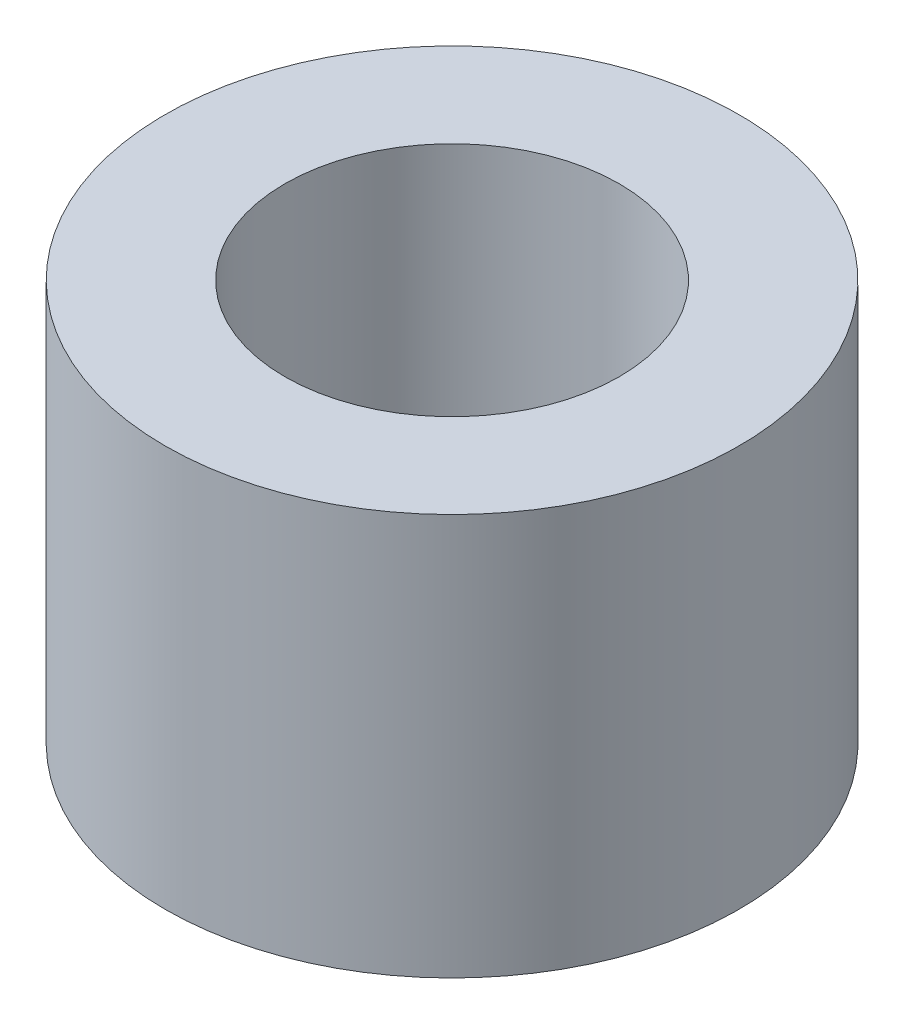
ISO-10303-21;
HEADER;
FILE_DESCRIPTION(('STEP AP214'),'2;1');
FILE_NAME('part.step','',(''),(''),'','','');
FILE_SCHEMA(('AUTOMOTIVE_DESIGN { 1 0 10303 214 1 1 1 1 }'));
ENDSEC;
DATA;
#1=APPLICATION_CONTEXT('core data for automotive mechanical design processes');
#2=APPLICATION_PROTOCOL_DEFINITION('international standard','automotive_design',2000,#1);
#3=PRODUCT_CONTEXT('',#1,'mechanical');
#4=PRODUCT('Part','Part','',(#3));
#5=PRODUCT_RELATED_PRODUCT_CATEGORY('part','',(#4));
#6=PRODUCT_DEFINITION_FORMATION('','',#4);
#7=PRODUCT_DEFINITION_CONTEXT('part definition',#1,'design');
#8=PRODUCT_DEFINITION('design','',#6,#7);
#9=PRODUCT_DEFINITION_SHAPE('','',#8);
#10=(LENGTH_UNIT() NAMED_UNIT(*) SI_UNIT(.MILLI.,.METRE.));
#11=(NAMED_UNIT(*) PLANE_ANGLE_UNIT() SI_UNIT($,.RADIAN.));
#12=(NAMED_UNIT(*) SI_UNIT($,.STERADIAN.) SOLID_ANGLE_UNIT());
#13=UNCERTAINTY_MEASURE_WITH_UNIT(LENGTH_MEASURE(1.E-05),#10,'distance_accuracy_value','');
#14=(GEOMETRIC_REPRESENTATION_CONTEXT(3) GLOBAL_UNCERTAINTY_ASSIGNED_CONTEXT((#13)) GLOBAL_UNIT_ASSIGNED_CONTEXT((#10,
#11,#12)) REPRESENTATION_CONTEXT('',''));
#15=CARTESIAN_POINT('',(0.,0.,0.));
#16=DIRECTION('',(0.,0.,1.));
#17=DIRECTION('',(1.,0.,0.));
#18=AXIS2_PLACEMENT_3D('',#15,#16,#17);
#19=CARTESIAN_POINT('',(0.,10.,0.));
#20=DIRECTION('',(0.,1.,0.));
#21=DIRECTION('',(0.,0.,1.));
#22=AXIS2_PLACEMENT_3D('',#19,#20,#21);
#23=PLANE('',#22);
#24=CARTESIAN_POINT('',(0.,10.,0.));
#25=DIRECTION('',(0.,1.,0.));
#26=DIRECTION('',(0.,0.,1.));
#27=AXIS2_PLACEMENT_3D('',#24,#25,#26);
#28=CIRCLE('',#27,7.1501);
#29=CARTESIAN_POINT('',(0.,10.,7.1501));
#30=VERTEX_POINT('',#29);
#31=EDGE_CURVE('E10',#30,#30,#28,.T.);
#32=ORIENTED_EDGE('',*,*,#31,.T.);
#33=EDGE_LOOP('',(#32));
#34=FACE_BOUND('',#33,.T.);
#35=CARTESIAN_POINT('',(0.,10.,0.));
#36=DIRECTION('',(0.,1.,0.));
#37=DIRECTION('',(0.,0.,1.));
#38=AXIS2_PLACEMENT_3D('',#35,#36,#37);
#39=CIRCLE('',#38,4.1656);
#40=CARTESIAN_POINT('',(0.,10.,4.1656));
#41=VERTEX_POINT('',#40);
#42=EDGE_CURVE('E42',#41,#41,#39,.T.);
#43=ORIENTED_EDGE('',*,*,#42,.F.);
#44=EDGE_LOOP('',(#43));
#45=FACE_BOUND('',#44,.T.);
#46=ADVANCED_FACE('F31',(#34,#45),#23,.T.);
#47=CARTESIAN_POINT('',(0.,0.,0.));
#48=DIRECTION('',(0.,1.,0.));
#49=DIRECTION('',(0.,0.,1.));
#50=AXIS2_PLACEMENT_3D('',#47,#48,#49);
#51=PLANE('',#50);
#52=CARTESIAN_POINT('',(0.,0.,0.));
#53=DIRECTION('',(0.,1.,0.));
#54=DIRECTION('',(0.,0.,1.));
#55=AXIS2_PLACEMENT_3D('',#52,#53,#54);
#56=CIRCLE('',#55,7.1501);
#57=CARTESIAN_POINT('',(0.,0.,7.1501));
#58=VERTEX_POINT('',#57);
#59=EDGE_CURVE('E35',#58,#58,#56,.T.);
#60=ORIENTED_EDGE('',*,*,#59,.F.);
#61=EDGE_LOOP('',(#60));
#62=FACE_BOUND('',#61,.T.);
#63=CARTESIAN_POINT('',(0.,0.,0.));
#64=DIRECTION('',(0.,1.,0.));
#65=DIRECTION('',(0.,0.,1.));
#66=AXIS2_PLACEMENT_3D('',#63,#64,#65);
#67=CIRCLE('',#66,4.1656);
#68=CARTESIAN_POINT('',(0.,0.,4.1656));
#69=VERTEX_POINT('',#68);
#70=EDGE_CURVE('E44',#69,#69,#67,.T.);
#71=ORIENTED_EDGE('',*,*,#70,.T.);
#72=EDGE_LOOP('',(#71));
#73=FACE_BOUND('',#72,.T.);
#74=ADVANCED_FACE('F54',(#62,#73),#51,.F.);
#75=CARTESIAN_POINT('',(0.,10.,0.));
#76=DIRECTION('',(0.,-1.,0.));
#77=DIRECTION('',(0.,0.,-1.));
#78=AXIS2_PLACEMENT_3D('',#75,#76,#77);
#79=CYLINDRICAL_SURFACE('',#78,7.1501);
#80=ORIENTED_EDGE('',*,*,#31,.F.);
#81=EDGE_LOOP('',(#80));
#82=FACE_BOUND('',#81,.T.);
#83=ORIENTED_EDGE('',*,*,#59,.T.);
#84=EDGE_LOOP('',(#83));
#85=FACE_BOUND('',#84,.T.);
#86=ADVANCED_FACE('F33',(#82,#85),#79,.T.);
#87=CARTESIAN_POINT('',(0.,10.,0.));
#88=DIRECTION('',(0.,-1.,0.));
#89=DIRECTION('',(0.,0.,-1.));
#90=AXIS2_PLACEMENT_3D('',#87,#88,#89);
#91=CYLINDRICAL_SURFACE('',#90,4.1656);
#92=ORIENTED_EDGE('',*,*,#42,.T.);
#93=EDGE_LOOP('',(#92));
#94=FACE_BOUND('',#93,.T.);
#95=ORIENTED_EDGE('',*,*,#70,.F.);
#96=EDGE_LOOP('',(#95));
#97=FACE_BOUND('',#96,.T.);
#98=ADVANCED_FACE('F50',(#94,#97),#91,.F.);
#99=CLOSED_SHELL('',(#46,#74,#86,#98));
#100=MANIFOLD_SOLID_BREP('B2',#99);
#101=ADVANCED_BREP_SHAPE_REPRESENTATION('',(#18,#100),#14);
#102=SHAPE_DEFINITION_REPRESENTATION(#9,#101);
ENDSEC;
END-ISO-10303-21;
